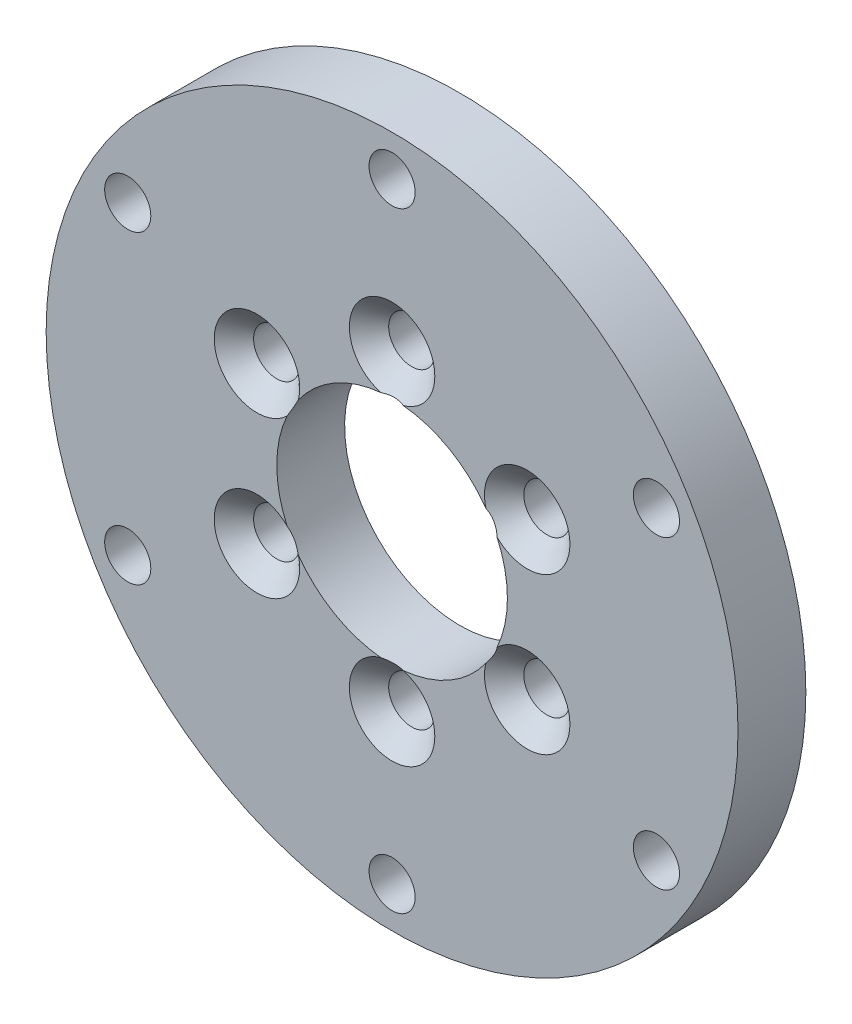
ISO-10303-21;
HEADER;
FILE_DESCRIPTION(('STEP AP214'),'2;1');
FILE_NAME('part.step','',(''),(''),'','','');
FILE_SCHEMA(('AUTOMOTIVE_DESIGN { 1 0 10303 214 1 1 1 1 }'));
ENDSEC;
DATA;
#1=APPLICATION_CONTEXT('core data for automotive mechanical design processes');
#2=APPLICATION_PROTOCOL_DEFINITION('international standard','automotive_design',2000,#1);
#3=PRODUCT_CONTEXT('',#1,'mechanical');
#4=PRODUCT('Part','Part','',(#3));
#5=PRODUCT_RELATED_PRODUCT_CATEGORY('part','',(#4));
#6=PRODUCT_DEFINITION_FORMATION('','',#4);
#7=PRODUCT_DEFINITION_CONTEXT('part definition',#1,'design');
#8=PRODUCT_DEFINITION('design','',#6,#7);
#9=PRODUCT_DEFINITION_SHAPE('','',#8);
#10=(LENGTH_UNIT() NAMED_UNIT(*) SI_UNIT(.MILLI.,.METRE.));
#11=(NAMED_UNIT(*) PLANE_ANGLE_UNIT() SI_UNIT($,.RADIAN.));
#12=(NAMED_UNIT(*) SI_UNIT($,.STERADIAN.) SOLID_ANGLE_UNIT());
#13=UNCERTAINTY_MEASURE_WITH_UNIT(LENGTH_MEASURE(1.E-05),#10,'distance_accuracy_value','');
#14=(GEOMETRIC_REPRESENTATION_CONTEXT(3) GLOBAL_UNCERTAINTY_ASSIGNED_CONTEXT((#13)) GLOBAL_UNIT_ASSIGNED_CONTEXT((#10,
#11,#12)) REPRESENTATION_CONTEXT('',''));
#15=CARTESIAN_POINT('',(0.,0.,0.));
#16=DIRECTION('',(0.,0.,1.));
#17=DIRECTION('',(1.,0.,0.));
#18=AXIS2_PLACEMENT_3D('',#15,#16,#17);
#19=CARTESIAN_POINT('',(0.,0.,5.));
#20=DIRECTION('',(0.,0.,1.));
#21=DIRECTION('',(1.,0.,0.));
#22=AXIS2_PLACEMENT_3D('',#19,#20,#21);
#23=PLANE('',#22);
#24=CARTESIAN_POINT('',(9.95929214352098,5.75000000000012,5.));
#25=DIRECTION('',(0.,0.,1.));
#26=DIRECTION('',(1.,0.,0.));
#27=AXIS2_PLACEMENT_3D('',#24,#25,#26);
#28=CIRCLE('',#27,3.15);
#29=CARTESIAN_POINT('',(7.7388638324901,3.51567725796562,5.));
#30=VERTEX_POINT('',#29);
#31=CARTESIAN_POINT('',(6.91409773315038,4.94421404638238,5.));
#32=VERTEX_POINT('',#31);
#33=EDGE_CURVE('E51',#30,#32,#28,.T.);
#34=ORIENTED_EDGE('',*,*,#33,.F.);
#35=CARTESIAN_POINT('',(0.,0.,5.));
#36=DIRECTION('',(0.,0.,1.));
#37=DIRECTION('',(1.,0.,0.));
#38=AXIS2_PLACEMENT_3D('',#35,#36,#37);
#39=CIRCLE('',#38,8.5);
#40=CARTESIAN_POINT('',(7.73886383249017,-3.51567725796546,5.));
#41=VERTEX_POINT('',#40);
#42=EDGE_CURVE('E95',#41,#30,#39,.T.);
#43=ORIENTED_EDGE('',*,*,#42,.F.);
#44=CARTESIAN_POINT('',(9.9592921435211,-5.74999999999991,5.));
#45=DIRECTION('',(0.,0.,1.));
#46=DIRECTION('',(1.,0.,0.));
#47=AXIS2_PLACEMENT_3D('',#44,#45,#46);
#48=CIRCLE('',#47,3.15);
#49=CARTESIAN_POINT('',(6.91409773315048,-4.94421404638223,5.));
#50=VERTEX_POINT('',#49);
#51=EDGE_CURVE('E58',#50,#41,#48,.T.);
#52=ORIENTED_EDGE('',*,*,#51,.F.);
#53=CARTESIAN_POINT('',(0.824766099339699,-8.45989130434783,5.));
#54=VERTEX_POINT('',#53);
#55=EDGE_CURVE('E103',#54,#50,#39,.T.);
#56=ORIENTED_EDGE('',*,*,#55,.F.);
#57=CARTESIAN_POINT('',(0.,-11.5,5.));
#58=DIRECTION('',(0.,0.,1.));
#59=DIRECTION('',(1.,0.,0.));
#60=AXIS2_PLACEMENT_3D('',#57,#58,#59);
#61=CIRCLE('',#60,3.15);
#62=CARTESIAN_POINT('',(-0.824766099339706,-8.45989130434783,5.));
#63=VERTEX_POINT('',#62);
#64=EDGE_CURVE('E255',#63,#54,#61,.T.);
#65=ORIENTED_EDGE('',*,*,#64,.F.);
#66=CARTESIAN_POINT('',(-6.91409773315042,-4.94421404638232,5.));
#67=VERTEX_POINT('',#66);
#68=EDGE_CURVE('E105',#67,#63,#39,.T.);
#69=ORIENTED_EDGE('',*,*,#68,.F.);
#70=CARTESIAN_POINT('',(-9.95929214352102,-5.75000000000005,5.));
#71=DIRECTION('',(0.,0.,1.));
#72=DIRECTION('',(1.,0.,0.));
#73=AXIS2_PLACEMENT_3D('',#70,#71,#72);
#74=CIRCLE('',#73,3.15);
#75=CARTESIAN_POINT('',(-7.73886383249013,-3.51567725796556,5.));
#76=VERTEX_POINT('',#75);
#77=EDGE_CURVE('E250',#76,#67,#74,.T.);
#78=ORIENTED_EDGE('',*,*,#77,.F.);
#79=CARTESIAN_POINT('',(-7.73886383249015,3.51567725796552,5.));
#80=VERTEX_POINT('',#79);
#81=EDGE_CURVE('E112',#80,#76,#39,.T.);
#82=ORIENTED_EDGE('',*,*,#81,.F.);
#83=CARTESIAN_POINT('',(-9.95929214352106,5.74999999999998,5.));
#84=DIRECTION('',(0.,0.,1.));
#85=DIRECTION('',(1.,0.,0.));
#86=AXIS2_PLACEMENT_3D('',#83,#84,#85);
#87=CIRCLE('',#86,3.15);
#88=CARTESIAN_POINT('',(-6.91409773315045,4.94421404638228,5.));
#89=VERTEX_POINT('',#88);
#90=EDGE_CURVE('E245',#89,#80,#87,.T.);
#91=ORIENTED_EDGE('',*,*,#90,.F.);
#92=CARTESIAN_POINT('',(-0.824766099339699,8.45989130434783,5.));
#93=VERTEX_POINT('',#92);
#94=EDGE_CURVE('E107',#93,#89,#39,.T.);
#95=ORIENTED_EDGE('',*,*,#94,.F.);
#96=CARTESIAN_POINT('',(0.,11.5,5.));
#97=DIRECTION('',(0.,0.,1.));
#98=DIRECTION('',(1.,0.,0.));
#99=AXIS2_PLACEMENT_3D('',#96,#97,#98);
#100=CIRCLE('',#99,3.15);
#101=CARTESIAN_POINT('',(0.824766099339706,8.45989130434783,5.));
#102=VERTEX_POINT('',#101);
#103=EDGE_CURVE('E220',#102,#93,#100,.T.);
#104=ORIENTED_EDGE('',*,*,#103,.F.);
#105=EDGE_CURVE('E97',#32,#102,#39,.T.);
#106=ORIENTED_EDGE('',*,*,#105,.F.);
#107=EDGE_LOOP('',(#34,#43,#52,#56,#65,#69,#78,#82,#91,#95,#104,#106));
#108=FACE_BOUND('',#107,.T.);
#109=CARTESIAN_POINT('',(19.4855715851497,11.2500000000002,5.));
#110=DIRECTION('',(0.,0.,1.));
#111=DIRECTION('',(1.,0.,0.));
#112=AXIS2_PLACEMENT_3D('',#109,#110,#111);
#113=CIRCLE('',#112,1.7);
#114=CARTESIAN_POINT('',(21.1855715851497,11.2500000000002,5.));
#115=VERTEX_POINT('',#114);
#116=EDGE_CURVE('E239',#115,#115,#113,.T.);
#117=ORIENTED_EDGE('',*,*,#116,.F.);
#118=EDGE_LOOP('',(#117));
#119=FACE_BOUND('',#118,.T.);
#120=CARTESIAN_POINT('',(19.48557158515,-11.2499999999998,5.));
#121=DIRECTION('',(0.,0.,1.));
#122=DIRECTION('',(1.,0.,0.));
#123=AXIS2_PLACEMENT_3D('',#120,#121,#122);
#124=CIRCLE('',#123,1.7);
#125=CARTESIAN_POINT('',(21.18557158515,-11.2499999999998,5.));
#126=VERTEX_POINT('',#125);
#127=EDGE_CURVE('E235',#126,#126,#124,.T.);
#128=ORIENTED_EDGE('',*,*,#127,.F.);
#129=EDGE_LOOP('',(#128));
#130=FACE_BOUND('',#129,.T.);
#131=CARTESIAN_POINT('',(0.,-22.5,5.));
#132=DIRECTION('',(0.,0.,1.));
#133=DIRECTION('',(1.,0.,0.));
#134=AXIS2_PLACEMENT_3D('',#131,#132,#133);
#135=CIRCLE('',#134,1.7);
#136=CARTESIAN_POINT('',(1.7,-22.5,5.));
#137=VERTEX_POINT('',#136);
#138=EDGE_CURVE('E231',#137,#137,#135,.T.);
#139=ORIENTED_EDGE('',*,*,#138,.F.);
#140=EDGE_LOOP('',(#139));
#141=FACE_BOUND('',#140,.T.);
#142=CARTESIAN_POINT('',(-19.4855715851498,-11.2500000000001,5.));
#143=DIRECTION('',(0.,0.,1.));
#144=DIRECTION('',(1.,0.,0.));
#145=AXIS2_PLACEMENT_3D('',#142,#143,#144);
#146=CIRCLE('',#145,1.7);
#147=CARTESIAN_POINT('',(-17.7855715851498,-11.2500000000001,5.));
#148=VERTEX_POINT('',#147);
#149=EDGE_CURVE('E227',#148,#148,#146,.T.);
#150=ORIENTED_EDGE('',*,*,#149,.F.);
#151=EDGE_LOOP('',(#150));
#152=FACE_BOUND('',#151,.T.);
#153=CARTESIAN_POINT('',(-19.4855715851499,11.25,5.));
#154=DIRECTION('',(0.,0.,1.));
#155=DIRECTION('',(1.,0.,0.));
#156=AXIS2_PLACEMENT_3D('',#153,#154,#155);
#157=CIRCLE('',#156,1.7);
#158=CARTESIAN_POINT('',(-17.7855715851499,11.25,5.));
#159=VERTEX_POINT('',#158);
#160=EDGE_CURVE('E224',#159,#159,#157,.T.);
#161=ORIENTED_EDGE('',*,*,#160,.F.);
#162=EDGE_LOOP('',(#161));
#163=FACE_BOUND('',#162,.T.);
#164=CARTESIAN_POINT('',(0.,22.5,5.));
#165=DIRECTION('',(0.,0.,1.));
#166=DIRECTION('',(1.,0.,0.));
#167=AXIS2_PLACEMENT_3D('',#164,#165,#166);
#168=CIRCLE('',#167,1.7);
#169=CARTESIAN_POINT('',(1.7,22.5,5.));
#170=VERTEX_POINT('',#169);
#171=EDGE_CURVE('E113',#170,#170,#168,.T.);
#172=ORIENTED_EDGE('',*,*,#171,.F.);
#173=EDGE_LOOP('',(#172));
#174=FACE_BOUND('',#173,.T.);
#175=CARTESIAN_POINT('',(0.,0.,5.));
#176=DIRECTION('',(0.,0.,1.));
#177=DIRECTION('',(1.,0.,0.));
#178=AXIS2_PLACEMENT_3D('',#175,#176,#177);
#179=CIRCLE('',#178,25.5);
#180=CARTESIAN_POINT('',(25.5,0.,5.));
#181=VERTEX_POINT('',#180);
#182=EDGE_CURVE('E118',#181,#181,#179,.T.);
#183=ORIENTED_EDGE('',*,*,#182,.T.);
#184=EDGE_LOOP('',(#183));
#185=FACE_BOUND('',#184,.T.);
#186=ADVANCED_FACE('F37',(#108,#119,#130,#141,#152,#163,#174,#185),#23,.T.);
#187=CARTESIAN_POINT('',(0.,0.,0.));
#188=DIRECTION('',(0.,0.,1.));
#189=DIRECTION('',(1.,0.,0.));
#190=AXIS2_PLACEMENT_3D('',#187,#188,#189);
#191=PLANE('',#190);
#192=CARTESIAN_POINT('',(9.95929214352098,5.75000000000012,0.));
#193=DIRECTION('',(0.,0.,1.));
#194=DIRECTION('',(1.,0.,0.));
#195=AXIS2_PLACEMENT_3D('',#192,#193,#194);
#196=CIRCLE('',#195,1.69999999999999);
#197=CARTESIAN_POINT('',(11.659292143521,5.75000000000012,0.));
#198=VERTEX_POINT('',#197);
#199=EDGE_CURVE('E41',#198,#198,#196,.T.);
#200=ORIENTED_EDGE('',*,*,#199,.T.);
#201=EDGE_LOOP('',(#200));
#202=FACE_BOUND('',#201,.T.);
#203=CARTESIAN_POINT('',(9.9592921435211,-5.74999999999991,0.));
#204=DIRECTION('',(0.,0.,1.));
#205=DIRECTION('',(1.,0.,0.));
#206=AXIS2_PLACEMENT_3D('',#203,#204,#205);
#207=CIRCLE('',#206,1.69999999999999);
#208=CARTESIAN_POINT('',(11.6592921435211,-5.74999999999991,0.));
#209=VERTEX_POINT('',#208);
#210=EDGE_CURVE('E175',#209,#209,#207,.T.);
#211=ORIENTED_EDGE('',*,*,#210,.T.);
#212=EDGE_LOOP('',(#211));
#213=FACE_BOUND('',#212,.T.);
#214=CARTESIAN_POINT('',(0.,-11.5,0.));
#215=DIRECTION('',(0.,0.,1.));
#216=DIRECTION('',(1.,0.,0.));
#217=AXIS2_PLACEMENT_3D('',#214,#215,#216);
#218=CIRCLE('',#217,1.69999999999999);
#219=CARTESIAN_POINT('',(1.69999999999999,-11.5,0.));
#220=VERTEX_POINT('',#219);
#221=EDGE_CURVE('E179',#220,#220,#218,.T.);
#222=ORIENTED_EDGE('',*,*,#221,.T.);
#223=EDGE_LOOP('',(#222));
#224=FACE_BOUND('',#223,.T.);
#225=CARTESIAN_POINT('',(-9.95929214352102,-5.75000000000005,0.));
#226=DIRECTION('',(0.,0.,1.));
#227=DIRECTION('',(1.,0.,0.));
#228=AXIS2_PLACEMENT_3D('',#225,#226,#227);
#229=CIRCLE('',#228,1.69999999999999);
#230=CARTESIAN_POINT('',(-8.25929214352103,-5.75000000000005,0.));
#231=VERTEX_POINT('',#230);
#232=EDGE_CURVE('E183',#231,#231,#229,.T.);
#233=ORIENTED_EDGE('',*,*,#232,.T.);
#234=EDGE_LOOP('',(#233));
#235=FACE_BOUND('',#234,.T.);
#236=CARTESIAN_POINT('',(-9.95929214352106,5.74999999999998,0.));
#237=DIRECTION('',(0.,0.,1.));
#238=DIRECTION('',(1.,0.,0.));
#239=AXIS2_PLACEMENT_3D('',#236,#237,#238);
#240=CIRCLE('',#239,1.69999999999999);
#241=CARTESIAN_POINT('',(-8.25929214352107,5.74999999999998,0.));
#242=VERTEX_POINT('',#241);
#243=EDGE_CURVE('E187',#242,#242,#240,.T.);
#244=ORIENTED_EDGE('',*,*,#243,.T.);
#245=EDGE_LOOP('',(#244));
#246=FACE_BOUND('',#245,.T.);
#247=CARTESIAN_POINT('',(19.4855715851497,11.2500000000002,0.));
#248=DIRECTION('',(0.,0.,1.));
#249=DIRECTION('',(1.,0.,0.));
#250=AXIS2_PLACEMENT_3D('',#247,#248,#249);
#251=CIRCLE('',#250,1.7);
#252=CARTESIAN_POINT('',(21.1855715851497,11.2500000000002,0.));
#253=VERTEX_POINT('',#252);
#254=EDGE_CURVE('E191',#253,#253,#251,.T.);
#255=ORIENTED_EDGE('',*,*,#254,.T.);
#256=EDGE_LOOP('',(#255));
#257=FACE_BOUND('',#256,.T.);
#258=CARTESIAN_POINT('',(19.48557158515,-11.2499999999998,0.));
#259=DIRECTION('',(0.,0.,1.));
#260=DIRECTION('',(1.,0.,0.));
#261=AXIS2_PLACEMENT_3D('',#258,#259,#260);
#262=CIRCLE('',#261,1.7);
#263=CARTESIAN_POINT('',(21.18557158515,-11.2499999999998,0.));
#264=VERTEX_POINT('',#263);
#265=EDGE_CURVE('E195',#264,#264,#262,.T.);
#266=ORIENTED_EDGE('',*,*,#265,.T.);
#267=EDGE_LOOP('',(#266));
#268=FACE_BOUND('',#267,.T.);
#269=CARTESIAN_POINT('',(0.,-22.5,0.));
#270=DIRECTION('',(0.,0.,1.));
#271=DIRECTION('',(1.,0.,0.));
#272=AXIS2_PLACEMENT_3D('',#269,#270,#271);
#273=CIRCLE('',#272,1.7);
#274=CARTESIAN_POINT('',(1.7,-22.5,0.));
#275=VERTEX_POINT('',#274);
#276=EDGE_CURVE('E199',#275,#275,#273,.T.);
#277=ORIENTED_EDGE('',*,*,#276,.T.);
#278=EDGE_LOOP('',(#277));
#279=FACE_BOUND('',#278,.T.);
#280=CARTESIAN_POINT('',(-19.4855715851498,-11.2500000000001,0.));
#281=DIRECTION('',(0.,0.,1.));
#282=DIRECTION('',(1.,0.,0.));
#283=AXIS2_PLACEMENT_3D('',#280,#281,#282);
#284=CIRCLE('',#283,1.7);
#285=CARTESIAN_POINT('',(-17.7855715851498,-11.2500000000001,0.));
#286=VERTEX_POINT('',#285);
#287=EDGE_CURVE('E203',#286,#286,#284,.T.);
#288=ORIENTED_EDGE('',*,*,#287,.T.);
#289=EDGE_LOOP('',(#288));
#290=FACE_BOUND('',#289,.T.);
#291=CARTESIAN_POINT('',(-19.4855715851499,11.25,0.));
#292=DIRECTION('',(0.,0.,1.));
#293=DIRECTION('',(1.,0.,0.));
#294=AXIS2_PLACEMENT_3D('',#291,#292,#293);
#295=CIRCLE('',#294,1.7);
#296=CARTESIAN_POINT('',(-17.7855715851499,11.25,0.));
#297=VERTEX_POINT('',#296);
#298=EDGE_CURVE('E207',#297,#297,#295,.T.);
#299=ORIENTED_EDGE('',*,*,#298,.T.);
#300=EDGE_LOOP('',(#299));
#301=FACE_BOUND('',#300,.T.);
#302=CARTESIAN_POINT('',(0.,11.5,0.));
#303=DIRECTION('',(0.,0.,1.));
#304=DIRECTION('',(1.,0.,0.));
#305=AXIS2_PLACEMENT_3D('',#302,#303,#304);
#306=CIRCLE('',#305,1.69999999999999);
#307=CARTESIAN_POINT('',(1.69999999999999,11.5,0.));
#308=VERTEX_POINT('',#307);
#309=EDGE_CURVE('E135',#308,#308,#306,.T.);
#310=ORIENTED_EDGE('',*,*,#309,.T.);
#311=EDGE_LOOP('',(#310));
#312=FACE_BOUND('',#311,.T.);
#313=CARTESIAN_POINT('',(0.,22.5,0.));
#314=DIRECTION('',(0.,0.,1.));
#315=DIRECTION('',(1.,0.,0.));
#316=AXIS2_PLACEMENT_3D('',#313,#314,#315);
#317=CIRCLE('',#316,1.7);
#318=CARTESIAN_POINT('',(1.7,22.5,0.));
#319=VERTEX_POINT('',#318);
#320=EDGE_CURVE('E117',#319,#319,#317,.T.);
#321=ORIENTED_EDGE('',*,*,#320,.T.);
#322=EDGE_LOOP('',(#321));
#323=FACE_BOUND('',#322,.T.);
#324=CARTESIAN_POINT('',(0.,0.,0.));
#325=DIRECTION('',(0.,0.,1.));
#326=DIRECTION('',(1.,0.,0.));
#327=AXIS2_PLACEMENT_3D('',#324,#325,#326);
#328=CIRCLE('',#327,25.5);
#329=CARTESIAN_POINT('',(25.5,0.,0.));
#330=VERTEX_POINT('',#329);
#331=EDGE_CURVE('E111',#330,#330,#328,.T.);
#332=ORIENTED_EDGE('',*,*,#331,.F.);
#333=EDGE_LOOP('',(#332));
#334=FACE_BOUND('',#333,.T.);
#335=CARTESIAN_POINT('',(0.,0.,0.));
#336=DIRECTION('',(0.,0.,1.));
#337=DIRECTION('',(1.,0.,0.));
#338=AXIS2_PLACEMENT_3D('',#335,#336,#337);
#339=CIRCLE('',#338,8.5);
#340=CARTESIAN_POINT('',(8.5,0.,0.));
#341=VERTEX_POINT('',#340);
#342=EDGE_CURVE('E106',#341,#341,#339,.T.);
#343=ORIENTED_EDGE('',*,*,#342,.T.);
#344=EDGE_LOOP('',(#343));
#345=FACE_BOUND('',#344,.T.);
#346=ADVANCED_FACE('F160',(#202,#213,#224,#235,#246,#257,#268,#279,#290,#301,#312,#323,#334,
#345),#191,.F.);
#347=CARTESIAN_POINT('',(0.,0.,5.));
#348=DIRECTION('',(0.,0.,-1.));
#349=DIRECTION('',(-1.,0.,0.));
#350=AXIS2_PLACEMENT_3D('',#347,#348,#349);
#351=CYLINDRICAL_SURFACE('',#350,25.5);
#352=ORIENTED_EDGE('',*,*,#182,.F.);
#353=EDGE_LOOP('',(#352));
#354=FACE_BOUND('',#353,.T.);
#355=ORIENTED_EDGE('',*,*,#331,.T.);
#356=EDGE_LOOP('',(#355));
#357=FACE_BOUND('',#356,.T.);
#358=ADVANCED_FACE('F39',(#354,#357),#351,.T.);
#359=CARTESIAN_POINT('',(0.,0.,5.));
#360=DIRECTION('',(0.,0.,-1.));
#361=DIRECTION('',(-1.,0.,0.));
#362=AXIS2_PLACEMENT_3D('',#359,#360,#361);
#363=CYLINDRICAL_SURFACE('',#362,8.5);
#364=CARTESIAN_POINT('',(6.5068500806798,5.46908603219562,5.31385173680727));
#365=CARTESIAN_POINT('',(6.5407551835526,5.42874602262753,5.28333468124978));
#366=CARTESIAN_POINT('',(6.57461932453324,5.38769618980559,5.25370436503601));
#367=CARTESIAN_POINT('',(6.64228660085572,5.30404818454236,5.19653785351285));
#368=CARTESIAN_POINT('',(6.6760896652659,5.26144879386374,5.16900336089661));
#369=CARTESIAN_POINT('',(6.77809325851891,5.13028507200025,5.0895235479295));
#370=CARTESIAN_POINT('',(6.8461477023595,5.03923129236404,5.04138375896298));
#371=CARTESIAN_POINT('',(6.98665034661481,4.84276081395732,4.95581321021918));
#372=CARTESIAN_POINT('',(7.05902861889443,4.73677781914301,4.91950652447139));
#373=CARTESIAN_POINT('',(7.16533850043693,4.57298151099657,4.88108396568665));
#374=CARTESIAN_POINT('',(7.20033200636368,4.51769296772942,4.87095364978124));
#375=CARTESIAN_POINT('',(7.26935535039613,4.40576756052776,4.85640343304476));
#376=CARTESIAN_POINT('',(7.30338529349496,4.34913084474232,4.85198290769498));
#377=CARTESIAN_POINT('',(7.37038292105931,4.23460531914297,4.84907452047322));
#378=CARTESIAN_POINT('',(7.40334272865701,4.17671092985945,4.85062354144748));
#379=CARTESIAN_POINT('',(7.46769772920806,4.0605310663602,4.85964171841778));
#380=CARTESIAN_POINT('',(7.49909267434032,4.00224553184824,4.86711180896408));
#381=CARTESIAN_POINT('',(7.59064802741876,3.82744059489892,4.89793543799617));
#382=CARTESIAN_POINT('',(7.64820214029731,3.71093310499801,4.9297016871714));
#383=CARTESIAN_POINT('',(7.7144756055704,3.56900130151891,4.97971887299088));
#384=CARTESIAN_POINT('',(7.72688844285406,3.54204367174945,4.9897338305949));
#385=CARTESIAN_POINT('',(7.78221066034984,3.42024012329896,5.03715952431388));
#386=CARTESIAN_POINT('',(7.8227798852287,3.32628127419171,5.07974579935709));
#387=CARTESIAN_POINT('',(7.89913518118754,3.14066442878618,5.17339604398624));
#388=CARTESIAN_POINT('',(7.93491530413223,3.0490094064912,5.22447038267306));
#389=CARTESIAN_POINT('',(8.00237779669009,2.86729762714694,5.33324837023544));
#390=CARTESIAN_POINT('',(8.03403197652618,2.77725515734137,5.39099300751319));
#391=CARTESIAN_POINT('',(8.0934092738255,2.59914128689402,5.51117930499668));
#392=CARTESIAN_POINT('',(8.12113440721618,2.51106889511705,5.57361853113279));
#393=CARTESIAN_POINT('',(8.176456312355,2.32511537512766,5.71044122332153));
#394=CARTESIAN_POINT('',(8.20356392063723,2.22745454246283,5.78531991142965));
#395=CARTESIAN_POINT('',(8.24104228050849,2.08270669557821,5.89974286270523));
#396=CARTESIAN_POINT('',(8.25294860115864,2.03500132674502,5.93802210495701));
#397=CARTESIAN_POINT('',(8.27580687968651,1.93995052904611,6.0152977668617));
#398=CARTESIAN_POINT('',(8.28675891733331,1.89260507039784,6.05429412623969));
#399=CARTESIAN_POINT('',(8.29725513043861,1.84541521084287,6.09360099544878));
#400=B_SPLINE_CURVE_WITH_KNOTS('',3,(#364,#365,#366,#367,#368,#369,#370,#371,#372,#373,#374,
#375,#376,#377,#378,#379,#380,#381,#382,#383,#384,#385,#386,#387,#388,#389,#390,#391,#392,#393,
#394,#395,#396,#397,#398,#399),.UNSPECIFIED.,.F.,.F.,(4,2,2,2,2,2,2,2,2,2,2,2,2,2,2,2,2,4),(0.,
0.182671782711016,0.365490422143891,0.735115633075327,1.13348812136976,1.3318925917216,
1.53027535938581,1.7298857943914,1.92952774112607,2.32867549527458,2.4226483138681,
2.75449758356921,3.08675526430154,3.42117572686211,3.75542397782578,4.13330280346754,
4.3202312767847,4.50714410961693),.UNSPECIFIED.);
#401=EDGE_CURVE('E11',#32,#30,#400,.T.);
#402=ORIENTED_EDGE('',*,*,#401,.F.);
#403=ORIENTED_EDGE('',*,*,#105,.T.);
#404=CARTESIAN_POINT('',(-0.825327846904115,8.45983651999994,5.00020000000024));
#405=CARTESIAN_POINT('',(-0.76309417556716,8.46591137768129,4.9780198116993));
#406=CARTESIAN_POINT('',(-0.700029380500351,8.47136722338119,4.95787128843067));
#407=CARTESIAN_POINT('',(-0.572408630825759,8.48094534716892,4.92222755946567));
#408=CARTESIAN_POINT('',(-0.507850682542096,8.48506571710023,4.90673901429159));
#409=CARTESIAN_POINT('',(-0.377846375955788,8.49184627474894,4.88112172482962));
#410=CARTESIAN_POINT('',(-0.3124044452753,8.49451207489441,4.87097238484778));
#411=CARTESIAN_POINT('',(-0.180875736914817,8.49832979057216,4.85640467212639));
#412=CARTESIAN_POINT('',(-0.114789367139612,8.49948260812229,4.85198288472522));
#413=CARTESIAN_POINT('',(0.0179731843495485,8.50024170641351,4.84907381748549));
#414=CARTESIAN_POINT('',(0.0846503543597136,8.49983759040838,4.85062643287394));
#415=CARTESIAN_POINT('',(0.217581761965981,8.49747560202755,4.85966417113278));
#416=CARTESIAN_POINT('',(0.283835759524523,8.4955169152382,4.86715240357096));
#417=CARTESIAN_POINT('',(0.480941303876294,8.48739649321939,4.89800258330466));
#418=CARTESIAN_POINT('',(0.610492132162127,8.47899195479404,4.92974508116281));
#419=CARTESIAN_POINT('',(0.751528640186964,8.46672495163536,4.97495564294532));
#420=CARTESIAN_POINT('',(0.766356851003285,8.46539542251853,4.97984501311528));
#421=CARTESIAN_POINT('',(0.795912063253696,8.46266754538187,4.98985222639269));
#422=CARTESIAN_POINT('',(0.810639155010461,8.46126927149797,4.99496982284518));
#423=CARTESIAN_POINT('',(0.825327846904115,8.45983651999994,5.00020000000024));
#424=B_SPLINE_CURVE_WITH_KNOTS('',3,(#404,#405,#406,#407,#408,#409,#410,#411,#412,#413,#414,
#415,#416,#417,#418,#419,#420,#421,#422,#423),.UNSPECIFIED.,.F.,.F.,(4,2,2,2,2,2,2,2,2,4),(0.,
0.199067308403947,0.398417807269423,0.596993576822487,0.795450904577426,0.995235761843916,
1.19512535219442,1.59385206098399,1.64086488526615,1.68782807675992),.UNSPECIFIED.);
#425=EDGE_CURVE('E121',#93,#102,#424,.T.);
#426=ORIENTED_EDGE('',*,*,#425,.F.);
#427=ORIENTED_EDGE('',*,*,#94,.T.);
#428=CARTESIAN_POINT('',(-8.29725513043864,1.84541521084274,6.09360099544879));
#429=CARTESIAN_POINT('',(-8.28522787371931,1.89948656727792,6.04856386304438));
#430=CARTESIAN_POINT('',(-8.27260308819338,1.95376103878222,6.00393268897847));
#431=CARTESIAN_POINT('',(-8.24609115010855,2.06279727231844,5.91562641413488));
#432=CARTESIAN_POINT('',(-8.23220371825199,2.11755913973398,5.87195152755222));
#433=CARTESIAN_POINT('',(-8.18841225327012,2.28320066189986,5.74218490227078));
#434=CARTESIAN_POINT('',(-8.15649560172575,2.39490766111956,5.65779568295194));
#435=CARTESIAN_POINT('',(-8.08657583481561,2.62132901510587,5.49529639241282));
#436=CARTESIAN_POINT('',(-8.04856137775727,2.73604863406398,5.41719843746496));
#437=CARTESIAN_POINT('',(-7.96564152289289,2.96880066809847,5.27050258916677));
#438=CARTESIAN_POINT('',(-7.92075221444629,3.08682483562235,5.2018832082354));
#439=CARTESIAN_POINT('',(-7.85123544253329,3.25746627891727,5.11409801237097));
#440=CARTESIAN_POINT('',(-7.82987565851902,3.30849865985662,5.08925589682821));
#441=CARTESIAN_POINT('',(-7.78564315171739,3.41129094377156,5.04244558035464));
#442=CARTESIAN_POINT('',(-7.7627686696042,3.4630516357425,5.020480812852));
#443=CARTESIAN_POINT('',(-7.68740088412676,3.62897107012111,4.95590839897907));
#444=CARTESIAN_POINT('',(-7.63190357583945,3.74445309394657,4.91964840469304));
#445=CARTESIAN_POINT('',(-7.54327812138832,3.9183171119586,4.8811865627593));
#446=CARTESIAN_POINT('',(-7.51284045125975,3.97637732847052,4.87102068890056));
#447=CARTESIAN_POINT('',(-7.45030803667458,4.09233925662733,4.85642071099452));
#448=CARTESIAN_POINT('',(-7.41821353653516,4.15024099032371,4.85198576435765));
#449=CARTESIAN_POINT('',(-7.35245575218835,4.26565639756291,4.84907394850113));
#450=CARTESIAN_POINT('',(-7.31878592644076,4.32316705775241,4.85062460031707));
#451=CARTESIAN_POINT('',(-7.25032428614773,4.43702858032166,4.85965000322187));
#452=CARTESIAN_POINT('',(-7.21553228752186,4.49337924990812,4.86712573104602));
#453=CARTESIAN_POINT('',(-7.10993451728082,4.66004912397706,4.89795745330483));
#454=CARTESIAN_POINT('',(-7.03783746463179,4.76810781866165,4.92971602710551));
#455=CARTESIAN_POINT('',(-6.94808377861981,4.89643095634553,4.97971879834282));
#456=CARTESIAN_POINT('',(-6.93094445579484,4.92065927304505,4.98973364660932));
#457=CARTESIAN_POINT('',(-6.84679369617731,5.03831752465917,5.0410145480645));
#458=CARTESIAN_POINT('',(-6.77927481579095,5.12870083131161,5.08869506578217));
#459=CARTESIAN_POINT('',(-6.67754064347948,5.25961445745166,5.16782819720556));
#460=CARTESIAN_POINT('',(-6.64343955351583,5.30261004103308,5.19557933592932));
#461=CARTESIAN_POINT('',(-6.57519264557881,5.38699999989026,5.25320498537965));
#462=CARTESIAN_POINT('',(-6.54104694710605,5.42839642532323,5.28307662794891));
#463=CARTESIAN_POINT('',(-6.50685008067988,5.46908603219553,5.31385173680726));
#464=B_SPLINE_CURVE_WITH_KNOTS('',3,(#428,#429,#430,#431,#432,#433,#434,#435,#436,#437,#438,
#439,#440,#441,#442,#443,#444,#445,#446,#447,#448,#449,#450,#451,#452,#453,#454,#455,#456,#457,
#458,#459,#460,#461,#462,#463),.UNSPECIFIED.,.F.,.F.,(4,2,2,2,2,2,2,2,2,2,2,2,2,2,2,2,2,4),(0.,
0.214164587715417,0.428376664477643,0.858899851920446,1.29023328501304,1.72057226446061,
1.90241732619012,2.08447743751694,2.48208151148072,2.68087478702251,2.87963883165631,
3.07931785475741,3.27902980133898,3.67803930263058,3.77201212122846,4.13846813296122,
4.32292225136657,4.5071314669362),.UNSPECIFIED.);
#465=EDGE_CURVE('E134',#80,#89,#464,.T.);
#466=ORIENTED_EDGE('',*,*,#465,.F.);
#467=ORIENTED_EDGE('',*,*,#81,.T.);
#468=CARTESIAN_POINT('',(-6.50685008067984,-5.46908603219558,5.31385173680727));
#469=CARTESIAN_POINT('',(-6.54075518355254,-5.4287460226276,5.28333468124987));
#470=CARTESIAN_POINT('',(-6.57461932453309,-5.38769618980576,5.25370436503618));
#471=CARTESIAN_POINT('',(-6.64228660085539,-5.30404818454278,5.19653785351315));
#472=CARTESIAN_POINT('',(-6.67608966526547,-5.26144879386427,5.16900336089698));
#473=CARTESIAN_POINT('',(-6.77809325851821,-5.13028507200116,5.08952354793005));
#474=CARTESIAN_POINT('',(-6.84614770235862,-5.03923129236523,5.04138375896362));
#475=CARTESIAN_POINT('',(-6.9866503466138,-4.84276081395879,4.95581321021974));
#476=CARTESIAN_POINT('',(-7.05902861889347,-4.73677781914446,4.91950652447184));
#477=CARTESIAN_POINT('',(-7.16533850043604,-4.57298151099796,4.88108396568694));
#478=CARTESIAN_POINT('',(-7.20033200636283,-4.51769296773078,4.87095364978148));
#479=CARTESIAN_POINT('',(-7.26935535039533,-4.40576756052908,4.8564034330449));
#480=CARTESIAN_POINT('',(-7.30338529349419,-4.34913084474362,4.85198290769506));
#481=CARTESIAN_POINT('',(-7.3703829210586,-4.23460531914421,4.8490745204732));
#482=CARTESIAN_POINT('',(-7.40334272865633,-4.17671092986066,4.85062354144743));
#483=CARTESIAN_POINT('',(-7.46769772920745,-4.06053106636134,4.85964171841765));
#484=CARTESIAN_POINT('',(-7.49909267433974,-4.00224553184935,4.86711180896391));
#485=CARTESIAN_POINT('',(-7.59064802741826,-3.82744059489991,4.89793543799592));
#486=CARTESIAN_POINT('',(-7.64820214029687,-3.71093310499891,4.92970168717111));
#487=CARTESIAN_POINT('',(-7.71447560557053,-3.56900130151864,4.97971887299094));
#488=CARTESIAN_POINT('',(-7.72688844285468,-3.5420436717481,4.98973383059537));
#489=CARTESIAN_POINT('',(-7.78221066035098,-3.42024012329638,5.03715952431497));
#490=CARTESIAN_POINT('',(-7.82277988522987,-3.32628127418896,5.07974579935835));
#491=CARTESIAN_POINT('',(-7.89913518118876,-3.14066442878311,5.17339604398786));
#492=CARTESIAN_POINT('',(-7.93491530413347,-3.04900940648798,5.22447038267486));
#493=CARTESIAN_POINT('',(-8.00237779669136,-2.86729762714342,5.3332483702376));
#494=CARTESIAN_POINT('',(-8.03403197652745,-2.77725515733771,5.39099300751554));
#495=CARTESIAN_POINT('',(-8.09340927382677,-2.59914128689007,5.51117930499939));
#496=CARTESIAN_POINT('',(-8.12113440721745,-2.51106889511295,5.57361853113569));
#497=CARTESIAN_POINT('',(-8.17645631235598,-2.32511537512415,5.71044122332415));
#498=CARTESIAN_POINT('',(-8.20356392063798,-2.22745454246003,5.78531991143178));
#499=CARTESIAN_POINT('',(-8.24104228050893,-2.08270669557646,5.89974286270658));
#500=CARTESIAN_POINT('',(-8.25294860115899,-2.03500132674361,5.93802210495811));
#501=CARTESIAN_POINT('',(-8.27580687968667,-1.93995052904538,6.01529776686226));
#502=CARTESIAN_POINT('',(-8.2867589173334,-1.89260507039744,6.05429412623998));
#503=CARTESIAN_POINT('',(-8.29725513043862,-1.8454152108428,6.09360099544879));
#504=B_SPLINE_CURVE_WITH_KNOTS('',3,(#468,#469,#470,#471,#472,#473,#474,#475,#476,#477,#478,
#479,#480,#481,#482,#483,#484,#485,#486,#487,#488,#489,#490,#491,#492,#493,#494,#495,#496,#497,
#498,#499,#500,#501,#502,#503),.UNSPECIFIED.,.F.,.F.,(4,2,2,2,2,2,2,2,2,2,2,2,2,2,2,2,2,4),(0.,
0.182671782710519,0.365490422142897,0.735115633073323,1.13348812136799,1.33189259171995,
1.53027535938428,1.72988579439,1.9295277411248,2.32867549527357,2.42264831387086,
2.75449758357261,3.08675526430559,3.42117572686681,3.75542397783112,4.13330280347019,
4.32023127678603,4.50714410961694),.UNSPECIFIED.);
#505=EDGE_CURVE('E307',#67,#76,#504,.T.);
#506=ORIENTED_EDGE('',*,*,#505,.F.);
#507=ORIENTED_EDGE('',*,*,#68,.T.);
#508=CARTESIAN_POINT('',(0.825327846904115,-8.45983651999994,5.00020000000024));
#509=CARTESIAN_POINT('',(0.76309417556716,-8.46591137768129,4.9780198116993));
#510=CARTESIAN_POINT('',(0.700029380500351,-8.47136722338119,4.95787128843067));
#511=CARTESIAN_POINT('',(0.572408630825758,-8.48094534716892,4.92222755946567));
#512=CARTESIAN_POINT('',(0.507850682542096,-8.48506571710023,4.90673901429159));
#513=CARTESIAN_POINT('',(0.377846375955788,-8.49184627474894,4.88112172482962));
#514=CARTESIAN_POINT('',(0.3124044452753,-8.49451207489441,4.87097238484778));
#515=CARTESIAN_POINT('',(0.180875736914817,-8.49832979057216,4.85640467212639));
#516=CARTESIAN_POINT('',(0.114789367139612,-8.49948260812229,4.85198288472522));
#517=CARTESIAN_POINT('',(-0.0179731843495486,-8.50024170641351,4.84907381748549));
#518=CARTESIAN_POINT('',(-0.0846503543597137,-8.49983759040838,4.85062643287394));
#519=CARTESIAN_POINT('',(-0.217581761965981,-8.49747560202755,4.85966417113278));
#520=CARTESIAN_POINT('',(-0.283835759524523,-8.4955169152382,4.86715240357096));
#521=CARTESIAN_POINT('',(-0.480941303876294,-8.48739649321939,4.89800258330466));
#522=CARTESIAN_POINT('',(-0.610492132162127,-8.47899195479404,4.92974508116281));
#523=CARTESIAN_POINT('',(-0.751528640186965,-8.46672495163536,4.97495564294532));
#524=CARTESIAN_POINT('',(-0.766356851003285,-8.46539542251853,4.97984501311528));
#525=CARTESIAN_POINT('',(-0.795912063253696,-8.46266754538187,4.98985222639269));
#526=CARTESIAN_POINT('',(-0.810639155010461,-8.46126927149797,4.99496982284518));
#527=CARTESIAN_POINT('',(-0.825327846904115,-8.45983651999994,5.00020000000024));
#528=B_SPLINE_CURVE_WITH_KNOTS('',3,(#508,#509,#510,#511,#512,#513,#514,#515,#516,#517,#518,
#519,#520,#521,#522,#523,#524,#525,#526,#527),.UNSPECIFIED.,.F.,.F.,(4,2,2,2,2,2,2,2,2,4),(0.,
0.199067308403947,0.398417807269422,0.596993576822487,0.795450904577426,0.995235761843915,
1.19512535219442,1.59385206098399,1.64086488526615,1.68782807675992),.UNSPECIFIED.);
#529=EDGE_CURVE('E286',#54,#63,#528,.T.);
#530=ORIENTED_EDGE('',*,*,#529,.F.);
#531=ORIENTED_EDGE('',*,*,#55,.T.);
#532=CARTESIAN_POINT('',(8.29725513043865,-1.84541521084267,6.0936009954488));
#533=CARTESIAN_POINT('',(8.28522787371932,-1.89948656727786,6.04856386304439));
#534=CARTESIAN_POINT('',(8.2726030881934,-1.95376103878215,6.00393268897847));
#535=CARTESIAN_POINT('',(8.24609115010856,-2.06279727231837,5.91562641413488));
#536=CARTESIAN_POINT('',(8.23220371825201,-2.11755913973392,5.87195152755223));
#537=CARTESIAN_POINT('',(8.18841225327014,-2.28320066189979,5.74218490227078));
#538=CARTESIAN_POINT('',(8.15649560172577,-2.3949076611195,5.65779568295194));
#539=CARTESIAN_POINT('',(8.08657583481563,-2.62132901510581,5.49529639241282));
#540=CARTESIAN_POINT('',(8.04856137775729,-2.73604863406392,5.41719843746496));
#541=CARTESIAN_POINT('',(7.96564152289292,-2.96880066809841,5.27050258916677));
#542=CARTESIAN_POINT('',(7.92075221444631,-3.08682483562229,5.2018832082354));
#543=CARTESIAN_POINT('',(7.85123544253332,-3.25746627891721,5.11409801237097));
#544=CARTESIAN_POINT('',(7.82987565851905,-3.30849865985657,5.08925589682821));
#545=CARTESIAN_POINT('',(7.78564315171741,-3.41129094377151,5.04244558035464));
#546=CARTESIAN_POINT('',(7.76276866960422,-3.46305163574245,5.02048081285199));
#547=CARTESIAN_POINT('',(7.68740088412678,-3.62897107012107,4.95590839897907));
#548=CARTESIAN_POINT('',(7.63190357583948,-3.74445309394653,4.91964840469304));
#549=CARTESIAN_POINT('',(7.54327812138834,-3.91831711195855,4.8811865627593));
#550=CARTESIAN_POINT('',(7.51284045125978,-3.97637732847048,4.87102068890055));
#551=CARTESIAN_POINT('',(7.4503080366746,-4.09233925662729,4.85642071099451));
#552=CARTESIAN_POINT('',(7.41821353653518,-4.15024099032367,4.85198576435764));
#553=CARTESIAN_POINT('',(7.35245575218838,-4.26565639756286,4.84907394850113));
#554=CARTESIAN_POINT('',(7.31878592644078,-4.32316705775236,4.85062460031707));
#555=CARTESIAN_POINT('',(7.25032428614775,-4.43702858032161,4.85965000322187));
#556=CARTESIAN_POINT('',(7.21553228752188,-4.49337924990807,4.86712573104602));
#557=CARTESIAN_POINT('',(7.10993451728085,-4.66004912397701,4.89795745330483));
#558=CARTESIAN_POINT('',(7.03783746463182,-4.76810781866161,4.92971602710551));
#559=CARTESIAN_POINT('',(6.94808377861998,-4.89643095634528,4.97971879834274));
#560=CARTESIAN_POINT('',(6.93094445579515,-4.9206592730446,4.98973364660916));
#561=CARTESIAN_POINT('',(6.8467936961777,-5.03831752465865,5.04101454806425));
#562=CARTESIAN_POINT('',(6.77927481579128,-5.12870083131119,5.08869506578196));
#563=CARTESIAN_POINT('',(6.6775406434797,-5.25961445745138,5.16782819720541));
#564=CARTESIAN_POINT('',(6.64343955351602,-5.30261004103285,5.1955793359292));
#565=CARTESIAN_POINT('',(6.57519264557892,-5.38699999989012,5.25320498537959));
#566=CARTESIAN_POINT('',(6.54104694710613,-5.42839642532313,5.28307662794887));
#567=CARTESIAN_POINT('',(6.50685008067993,-5.46908603219547,5.31385173680725));
#568=B_SPLINE_CURVE_WITH_KNOTS('',3,(#532,#533,#534,#535,#536,#537,#538,#539,#540,#541,#542,
#543,#544,#545,#546,#547,#548,#549,#550,#551,#552,#553,#554,#555,#556,#557,#558,#559,#560,#561,
#562,#563,#564,#565,#566,#567),.UNSPECIFIED.,.F.,.F.,(4,2,2,2,2,2,2,2,2,2,2,2,2,2,2,2,2,4),(0.,
0.214164587715417,0.428376664477644,0.858899851920447,1.29023328501304,1.72057226446062,
1.90241732619014,2.08447743751696,2.48208151148074,2.68087478702253,2.87963883165633,
3.07931785475742,3.279029801339,3.67803930263059,3.77201212122771,4.13846813296083,
4.32292225136638,4.5071314669362),.UNSPECIFIED.);
#569=EDGE_CURVE('E46',#41,#50,#568,.T.);
#570=ORIENTED_EDGE('',*,*,#569,.F.);
#571=ORIENTED_EDGE('',*,*,#42,.T.);
#572=EDGE_LOOP('',(#402,#403,#426,#427,#466,#467,#506,#507,#530,#531,#570,#571));
#573=FACE_BOUND('',#572,.T.);
#574=ORIENTED_EDGE('',*,*,#342,.F.);
#575=EDGE_LOOP('',(#574));
#576=FACE_BOUND('',#575,.T.);
#577=ADVANCED_FACE('F100',(#573,#576),#363,.F.);
#578=CARTESIAN_POINT('',(0.,22.5,5.));
#579=DIRECTION('',(0.,0.,1.));
#580=DIRECTION('',(1.,0.,0.));
#581=AXIS2_PLACEMENT_3D('',#578,#579,#580);
#582=CYLINDRICAL_SURFACE('',#581,1.7);
#583=ORIENTED_EDGE('',*,*,#171,.T.);
#584=EDGE_LOOP('',(#583));
#585=FACE_BOUND('',#584,.T.);
#586=ORIENTED_EDGE('',*,*,#320,.F.);
#587=EDGE_LOOP('',(#586));
#588=FACE_BOUND('',#587,.T.);
#589=ADVANCED_FACE('F150',(#585,#588),#582,.F.);
#590=CARTESIAN_POINT('',(0.,11.5,5.));
#591=DIRECTION('',(0.,0.,1.));
#592=DIRECTION('',(1.,0.,0.));
#593=AXIS2_PLACEMENT_3D('',#590,#591,#592);
#594=CYLINDRICAL_SURFACE('',#593,1.69999999999999);
#595=CARTESIAN_POINT('',(0.,11.5,3.54999999999999));
#596=DIRECTION('',(0.,0.,1.));
#597=DIRECTION('',(1.,0.,0.));
#598=AXIS2_PLACEMENT_3D('',#595,#596,#597);
#599=CIRCLE('',#598,1.69999999999999);
#600=CARTESIAN_POINT('',(1.69999999999999,11.5,3.54999999999999));
#601=VERTEX_POINT('',#600);
#602=EDGE_CURVE('E218',#601,#601,#599,.T.);
#603=ORIENTED_EDGE('',*,*,#602,.T.);
#604=EDGE_LOOP('',(#603));
#605=FACE_BOUND('',#604,.T.);
#606=ORIENTED_EDGE('',*,*,#309,.F.);
#607=EDGE_LOOP('',(#606));
#608=FACE_BOUND('',#607,.T.);
#609=ADVANCED_FACE('F146',(#605,#608),#594,.F.);
#610=CARTESIAN_POINT('',(0.,11.5,5.));
#611=DIRECTION('',(0.,0.,1.));
#612=DIRECTION('',(1.,0.,0.));
#613=AXIS2_PLACEMENT_3D('',#610,#611,#612);
#614=CONICAL_SURFACE('',#613,3.15,0.78539816339745);
#615=ORIENTED_EDGE('',*,*,#425,.T.);
#616=ORIENTED_EDGE('',*,*,#103,.T.);
#617=EDGE_LOOP('',(#615,#616));
#618=FACE_BOUND('',#617,.T.);
#619=ORIENTED_EDGE('',*,*,#602,.F.);
#620=EDGE_LOOP('',(#619));
#621=FACE_BOUND('',#620,.T.);
#622=ADVANCED_FACE('F140',(#618,#621),#614,.F.);
#623=CARTESIAN_POINT('',(-19.4855715851499,11.25,5.));
#624=DIRECTION('',(0.,0.,1.));
#625=DIRECTION('',(1.,0.,0.));
#626=AXIS2_PLACEMENT_3D('',#623,#624,#625);
#627=CYLINDRICAL_SURFACE('',#626,1.7);
#628=ORIENTED_EDGE('',*,*,#160,.T.);
#629=EDGE_LOOP('',(#628));
#630=FACE_BOUND('',#629,.T.);
#631=ORIENTED_EDGE('',*,*,#298,.F.);
#632=EDGE_LOOP('',(#631));
#633=FACE_BOUND('',#632,.T.);
#634=ADVANCED_FACE('F145',(#630,#633),#627,.F.);
#635=CARTESIAN_POINT('',(-19.4855715851498,-11.2500000000001,5.));
#636=DIRECTION('',(0.,0.,1.));
#637=DIRECTION('',(1.,0.,0.));
#638=AXIS2_PLACEMENT_3D('',#635,#636,#637);
#639=CYLINDRICAL_SURFACE('',#638,1.7);
#640=ORIENTED_EDGE('',*,*,#149,.T.);
#641=EDGE_LOOP('',(#640));
#642=FACE_BOUND('',#641,.T.);
#643=ORIENTED_EDGE('',*,*,#287,.F.);
#644=EDGE_LOOP('',(#643));
#645=FACE_BOUND('',#644,.T.);
#646=ADVANCED_FACE('F454',(#642,#645),#639,.F.);
#647=CARTESIAN_POINT('',(0.,-22.5,5.));
#648=DIRECTION('',(0.,0.,1.));
#649=DIRECTION('',(1.,0.,0.));
#650=AXIS2_PLACEMENT_3D('',#647,#648,#649);
#651=CYLINDRICAL_SURFACE('',#650,1.7);
#652=ORIENTED_EDGE('',*,*,#138,.T.);
#653=EDGE_LOOP('',(#652));
#654=FACE_BOUND('',#653,.T.);
#655=ORIENTED_EDGE('',*,*,#276,.F.);
#656=EDGE_LOOP('',(#655));
#657=FACE_BOUND('',#656,.T.);
#658=ADVANCED_FACE('F444',(#654,#657),#651,.F.);
#659=CARTESIAN_POINT('',(19.48557158515,-11.2499999999998,5.));
#660=DIRECTION('',(0.,0.,1.));
#661=DIRECTION('',(1.,0.,0.));
#662=AXIS2_PLACEMENT_3D('',#659,#660,#661);
#663=CYLINDRICAL_SURFACE('',#662,1.7);
#664=ORIENTED_EDGE('',*,*,#127,.T.);
#665=EDGE_LOOP('',(#664));
#666=FACE_BOUND('',#665,.T.);
#667=ORIENTED_EDGE('',*,*,#265,.F.);
#668=EDGE_LOOP('',(#667));
#669=FACE_BOUND('',#668,.T.);
#670=ADVANCED_FACE('F435',(#666,#669),#663,.F.);
#671=CARTESIAN_POINT('',(19.4855715851497,11.2500000000002,5.));
#672=DIRECTION('',(0.,0.,1.));
#673=DIRECTION('',(1.,0.,0.));
#674=AXIS2_PLACEMENT_3D('',#671,#672,#673);
#675=CYLINDRICAL_SURFACE('',#674,1.7);
#676=ORIENTED_EDGE('',*,*,#116,.T.);
#677=EDGE_LOOP('',(#676));
#678=FACE_BOUND('',#677,.T.);
#679=ORIENTED_EDGE('',*,*,#254,.F.);
#680=EDGE_LOOP('',(#679));
#681=FACE_BOUND('',#680,.T.);
#682=ADVANCED_FACE('F426',(#678,#681),#675,.F.);
#683=CARTESIAN_POINT('',(-9.95929214352106,5.74999999999998,5.));
#684=DIRECTION('',(0.,0.,1.));
#685=DIRECTION('',(1.,0.,0.));
#686=AXIS2_PLACEMENT_3D('',#683,#684,#685);
#687=CYLINDRICAL_SURFACE('',#686,1.69999999999999);
#688=CARTESIAN_POINT('',(-9.95929214352106,5.74999999999998,3.54999999999999));
#689=DIRECTION('',(0.,0.,1.));
#690=DIRECTION('',(1.,0.,0.));
#691=AXIS2_PLACEMENT_3D('',#688,#689,#690);
#692=CIRCLE('',#691,1.69999999999999);
#693=CARTESIAN_POINT('',(-8.25929214352107,5.74999999999998,3.54999999999999));
#694=VERTEX_POINT('',#693);
#695=EDGE_CURVE('E242',#694,#694,#692,.T.);
#696=ORIENTED_EDGE('',*,*,#695,.T.);
#697=EDGE_LOOP('',(#696));
#698=FACE_BOUND('',#697,.T.);
#699=ORIENTED_EDGE('',*,*,#243,.F.);
#700=EDGE_LOOP('',(#699));
#701=FACE_BOUND('',#700,.T.);
#702=ADVANCED_FACE('F328',(#698,#701),#687,.F.);
#703=CARTESIAN_POINT('',(-9.95929214352106,5.74999999999998,5.));
#704=DIRECTION('',(0.,0.,1.));
#705=DIRECTION('',(1.,0.,0.));
#706=AXIS2_PLACEMENT_3D('',#703,#704,#705);
#707=CONICAL_SURFACE('',#706,3.15,0.78539816339745);
#708=ORIENTED_EDGE('',*,*,#465,.T.);
#709=ORIENTED_EDGE('',*,*,#90,.T.);
#710=EDGE_LOOP('',(#708,#709));
#711=FACE_BOUND('',#710,.T.);
#712=ORIENTED_EDGE('',*,*,#695,.F.);
#713=EDGE_LOOP('',(#712));
#714=FACE_BOUND('',#713,.T.);
#715=ADVANCED_FACE('F323',(#711,#714),#707,.F.);
#716=CARTESIAN_POINT('',(-9.95929214352102,-5.75000000000005,5.));
#717=DIRECTION('',(0.,0.,1.));
#718=DIRECTION('',(1.,0.,0.));
#719=AXIS2_PLACEMENT_3D('',#716,#717,#718);
#720=CYLINDRICAL_SURFACE('',#719,1.69999999999999);
#721=CARTESIAN_POINT('',(-9.95929214352102,-5.75000000000005,3.54999999999999));
#722=DIRECTION('',(0.,0.,1.));
#723=DIRECTION('',(1.,0.,0.));
#724=AXIS2_PLACEMENT_3D('',#721,#722,#723);
#725=CIRCLE('',#724,1.69999999999999);
#726=CARTESIAN_POINT('',(-8.25929214352103,-5.75000000000005,3.54999999999999));
#727=VERTEX_POINT('',#726);
#728=EDGE_CURVE('E247',#727,#727,#725,.T.);
#729=ORIENTED_EDGE('',*,*,#728,.T.);
#730=EDGE_LOOP('',(#729));
#731=FACE_BOUND('',#730,.T.);
#732=ORIENTED_EDGE('',*,*,#232,.F.);
#733=EDGE_LOOP('',(#732));
#734=FACE_BOUND('',#733,.T.);
#735=ADVANCED_FACE('F319',(#731,#734),#720,.F.);
#736=CARTESIAN_POINT('',(-9.95929214352102,-5.75000000000005,5.));
#737=DIRECTION('',(0.,0.,1.));
#738=DIRECTION('',(1.,0.,0.));
#739=AXIS2_PLACEMENT_3D('',#736,#737,#738);
#740=CONICAL_SURFACE('',#739,3.15,0.78539816339745);
#741=ORIENTED_EDGE('',*,*,#505,.T.);
#742=ORIENTED_EDGE('',*,*,#77,.T.);
#743=EDGE_LOOP('',(#741,#742));
#744=FACE_BOUND('',#743,.T.);
#745=ORIENTED_EDGE('',*,*,#728,.F.);
#746=EDGE_LOOP('',(#745));
#747=FACE_BOUND('',#746,.T.);
#748=ADVANCED_FACE('F315',(#744,#747),#740,.F.);
#749=CARTESIAN_POINT('',(0.,-11.5,5.));
#750=DIRECTION('',(0.,0.,1.));
#751=DIRECTION('',(1.,0.,0.));
#752=AXIS2_PLACEMENT_3D('',#749,#750,#751);
#753=CYLINDRICAL_SURFACE('',#752,1.69999999999999);
#754=CARTESIAN_POINT('',(0.,-11.5,3.54999999999999));
#755=DIRECTION('',(0.,0.,1.));
#756=DIRECTION('',(1.,0.,0.));
#757=AXIS2_PLACEMENT_3D('',#754,#755,#756);
#758=CIRCLE('',#757,1.69999999999999);
#759=CARTESIAN_POINT('',(1.69999999999999,-11.5,3.54999999999999));
#760=VERTEX_POINT('',#759);
#761=EDGE_CURVE('E252',#760,#760,#758,.T.);
#762=ORIENTED_EDGE('',*,*,#761,.T.);
#763=EDGE_LOOP('',(#762));
#764=FACE_BOUND('',#763,.T.);
#765=ORIENTED_EDGE('',*,*,#221,.F.);
#766=EDGE_LOOP('',(#765));
#767=FACE_BOUND('',#766,.T.);
#768=ADVANCED_FACE('F299',(#764,#767),#753,.F.);
#769=CARTESIAN_POINT('',(0.,-11.5,5.));
#770=DIRECTION('',(0.,0.,1.));
#771=DIRECTION('',(1.,0.,0.));
#772=AXIS2_PLACEMENT_3D('',#769,#770,#771);
#773=CONICAL_SURFACE('',#772,3.15,0.78539816339745);
#774=ORIENTED_EDGE('',*,*,#529,.T.);
#775=ORIENTED_EDGE('',*,*,#64,.T.);
#776=EDGE_LOOP('',(#774,#775));
#777=FACE_BOUND('',#776,.T.);
#778=ORIENTED_EDGE('',*,*,#761,.F.);
#779=EDGE_LOOP('',(#778));
#780=FACE_BOUND('',#779,.T.);
#781=ADVANCED_FACE('F294',(#777,#780),#773,.F.);
#782=CARTESIAN_POINT('',(9.9592921435211,-5.74999999999991,5.));
#783=DIRECTION('',(0.,0.,1.));
#784=DIRECTION('',(1.,0.,0.));
#785=AXIS2_PLACEMENT_3D('',#782,#783,#784);
#786=CYLINDRICAL_SURFACE('',#785,1.69999999999999);
#787=CARTESIAN_POINT('',(9.9592921435211,-5.74999999999991,3.54999999999999));
#788=DIRECTION('',(0.,0.,1.));
#789=DIRECTION('',(1.,0.,0.));
#790=AXIS2_PLACEMENT_3D('',#787,#788,#789);
#791=CIRCLE('',#790,1.69999999999999);
#792=CARTESIAN_POINT('',(11.6592921435211,-5.74999999999991,3.54999999999999));
#793=VERTEX_POINT('',#792);
#794=EDGE_CURVE('E257',#793,#793,#791,.T.);
#795=ORIENTED_EDGE('',*,*,#794,.T.);
#796=EDGE_LOOP('',(#795));
#797=FACE_BOUND('',#796,.T.);
#798=ORIENTED_EDGE('',*,*,#210,.F.);
#799=EDGE_LOOP('',(#798));
#800=FACE_BOUND('',#799,.T.);
#801=ADVANCED_FACE('F291',(#797,#800),#786,.F.);
#802=CARTESIAN_POINT('',(9.9592921435211,-5.74999999999991,5.));
#803=DIRECTION('',(0.,0.,1.));
#804=DIRECTION('',(1.,0.,0.));
#805=AXIS2_PLACEMENT_3D('',#802,#803,#804);
#806=CONICAL_SURFACE('',#805,3.15,0.78539816339745);
#807=ORIENTED_EDGE('',*,*,#569,.T.);
#808=ORIENTED_EDGE('',*,*,#51,.T.);
#809=EDGE_LOOP('',(#807,#808));
#810=FACE_BOUND('',#809,.T.);
#811=ORIENTED_EDGE('',*,*,#794,.F.);
#812=EDGE_LOOP('',(#811));
#813=FACE_BOUND('',#812,.T.);
#814=ADVANCED_FACE('F271',(#810,#813),#806,.F.);
#815=CARTESIAN_POINT('',(9.95929214352098,5.75000000000012,5.));
#816=DIRECTION('',(0.,0.,1.));
#817=DIRECTION('',(1.,0.,0.));
#818=AXIS2_PLACEMENT_3D('',#815,#816,#817);
#819=CYLINDRICAL_SURFACE('',#818,1.69999999999999);
#820=CARTESIAN_POINT('',(9.95929214352098,5.75000000000012,3.54999999999999));
#821=DIRECTION('',(0.,0.,1.));
#822=DIRECTION('',(1.,0.,0.));
#823=AXIS2_PLACEMENT_3D('',#820,#821,#822);
#824=CIRCLE('',#823,1.69999999999999);
#825=CARTESIAN_POINT('',(11.659292143521,5.75000000000012,3.54999999999999));
#826=VERTEX_POINT('',#825);
#827=EDGE_CURVE('E98',#826,#826,#824,.T.);
#828=ORIENTED_EDGE('',*,*,#827,.T.);
#829=EDGE_LOOP('',(#828));
#830=FACE_BOUND('',#829,.T.);
#831=ORIENTED_EDGE('',*,*,#199,.F.);
#832=EDGE_LOOP('',(#831));
#833=FACE_BOUND('',#832,.T.);
#834=ADVANCED_FACE('F264',(#830,#833),#819,.F.);
#835=CARTESIAN_POINT('',(9.95929214352098,5.75000000000012,5.));
#836=DIRECTION('',(0.,0.,1.));
#837=DIRECTION('',(1.,0.,0.));
#838=AXIS2_PLACEMENT_3D('',#835,#836,#837);
#839=CONICAL_SURFACE('',#838,3.15,0.78539816339745);
#840=ORIENTED_EDGE('',*,*,#401,.T.);
#841=ORIENTED_EDGE('',*,*,#33,.T.);
#842=EDGE_LOOP('',(#840,#841));
#843=FACE_BOUND('',#842,.T.);
#844=ORIENTED_EDGE('',*,*,#827,.F.);
#845=EDGE_LOOP('',(#844));
#846=FACE_BOUND('',#845,.T.);
#847=ADVANCED_FACE('F87',(#843,#846),#839,.F.);
#848=CLOSED_SHELL('',(#186,#346,#358,#577,#589,#609,#622,#634,#646,#658,#670,#682,#702,#715,
#735,#748,#768,#781,#801,#814,#834,#847));
#849=MANIFOLD_SOLID_BREP('B2',#848);
#850=ADVANCED_BREP_SHAPE_REPRESENTATION('',(#18,#849),#14);
#851=SHAPE_DEFINITION_REPRESENTATION(#9,#850);
ENDSEC;
END-ISO-10303-21;
